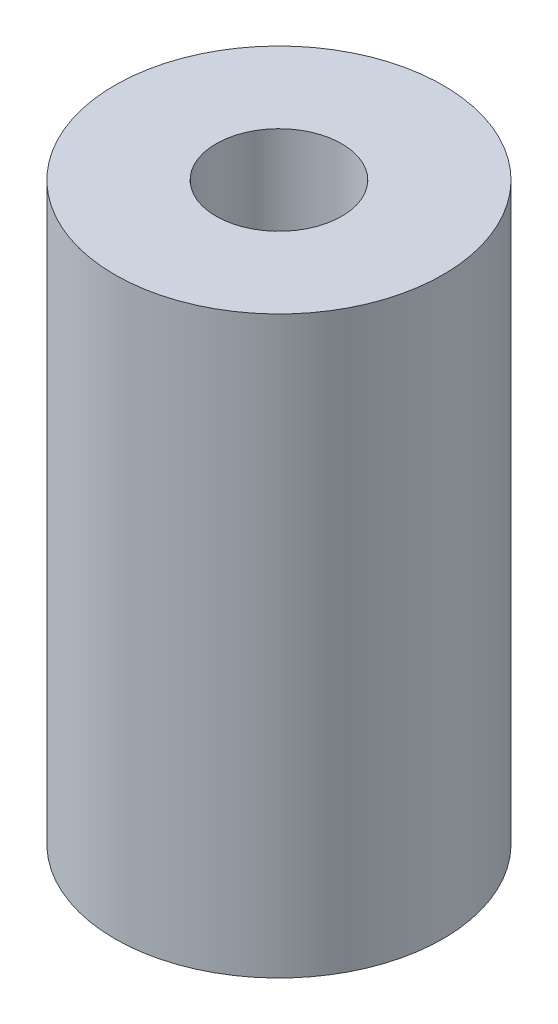
ISO-10303-21;
HEADER;
FILE_DESCRIPTION(('STEP AP214'),'2;1');
FILE_NAME('part.step','',(''),(''),'','','');
FILE_SCHEMA(('AUTOMOTIVE_DESIGN { 1 0 10303 214 1 1 1 1 }'));
ENDSEC;
DATA;
#1=APPLICATION_CONTEXT('core data for automotive mechanical design processes');
#2=APPLICATION_PROTOCOL_DEFINITION('international standard','automotive_design',2000,#1);
#3=PRODUCT_CONTEXT('',#1,'mechanical');
#4=PRODUCT('Part','Part','',(#3));
#5=PRODUCT_RELATED_PRODUCT_CATEGORY('part','',(#4));
#6=PRODUCT_DEFINITION_FORMATION('','',#4);
#7=PRODUCT_DEFINITION_CONTEXT('part definition',#1,'design');
#8=PRODUCT_DEFINITION('design','',#6,#7);
#9=PRODUCT_DEFINITION_SHAPE('','',#8);
#10=(LENGTH_UNIT() NAMED_UNIT(*) SI_UNIT(.MILLI.,.METRE.));
#11=(NAMED_UNIT(*) PLANE_ANGLE_UNIT() SI_UNIT($,.RADIAN.));
#12=(NAMED_UNIT(*) SI_UNIT($,.STERADIAN.) SOLID_ANGLE_UNIT());
#13=UNCERTAINTY_MEASURE_WITH_UNIT(LENGTH_MEASURE(1.E-05),#10,'distance_accuracy_value','');
#14=(GEOMETRIC_REPRESENTATION_CONTEXT(3) GLOBAL_UNCERTAINTY_ASSIGNED_CONTEXT((#13)) GLOBAL_UNIT_ASSIGNED_CONTEXT((#10,
#11,#12)) REPRESENTATION_CONTEXT('',''));
#15=CARTESIAN_POINT('',(0.,0.,0.));
#16=DIRECTION('',(0.,0.,1.));
#17=DIRECTION('',(1.,0.,0.));
#18=AXIS2_PLACEMENT_3D('',#15,#16,#17);
#19=CARTESIAN_POINT('',(0.,82.35,0.));
#20=DIRECTION('',(0.,-1.,0.));
#21=DIRECTION('',(0.,0.,-1.));
#22=AXIS2_PLACEMENT_3D('',#19,#20,#21);
#23=CYLINDRICAL_SURFACE('',#22,23.5);
#24=CARTESIAN_POINT('',(0.,82.35,0.));
#25=DIRECTION('',(0.,1.,0.));
#26=DIRECTION('',(0.,0.,1.));
#27=AXIS2_PLACEMENT_3D('',#24,#25,#26);
#28=CIRCLE('',#27,23.5);
#29=CARTESIAN_POINT('',(0.,82.35,23.5));
#30=VERTEX_POINT('',#29);
#31=EDGE_CURVE('E10',#30,#30,#28,.T.);
#32=ORIENTED_EDGE('',*,*,#31,.F.);
#33=EDGE_LOOP('',(#32));
#34=FACE_BOUND('',#33,.T.);
#35=CARTESIAN_POINT('',(0.,0.,0.));
#36=DIRECTION('',(0.,1.,0.));
#37=DIRECTION('',(0.,0.,1.));
#38=AXIS2_PLACEMENT_3D('',#35,#36,#37);
#39=CIRCLE('',#38,23.5);
#40=CARTESIAN_POINT('',(0.,0.,23.5));
#41=VERTEX_POINT('',#40);
#42=EDGE_CURVE('E45',#41,#41,#39,.T.);
#43=ORIENTED_EDGE('',*,*,#42,.T.);
#44=EDGE_LOOP('',(#43));
#45=FACE_BOUND('',#44,.T.);
#46=ADVANCED_FACE('F37',(#34,#45),#23,.T.);
#47=CARTESIAN_POINT('',(0.,82.35,0.));
#48=DIRECTION('',(0.,1.,0.));
#49=DIRECTION('',(0.,0.,1.));
#50=AXIS2_PLACEMENT_3D('',#47,#48,#49);
#51=PLANE('',#50);
#52=CARTESIAN_POINT('',(0.,82.35,0.));
#53=DIRECTION('',(0.,1.,0.));
#54=DIRECTION('',(0.,0.,1.));
#55=AXIS2_PLACEMENT_3D('',#52,#53,#54);
#56=CIRCLE('',#55,9.);
#57=CARTESIAN_POINT('',(0.,82.35,9.));
#58=VERTEX_POINT('',#57);
#59=EDGE_CURVE('E52',#58,#58,#56,.T.);
#60=ORIENTED_EDGE('',*,*,#59,.F.);
#61=EDGE_LOOP('',(#60));
#62=FACE_BOUND('',#61,.T.);
#63=ORIENTED_EDGE('',*,*,#31,.T.);
#64=EDGE_LOOP('',(#63));
#65=FACE_BOUND('',#64,.T.);
#66=ADVANCED_FACE('F70',(#62,#65),#51,.T.);
#67=CARTESIAN_POINT('',(0.,0.,0.));
#68=DIRECTION('',(0.,1.,0.));
#69=DIRECTION('',(0.,0.,1.));
#70=AXIS2_PLACEMENT_3D('',#67,#68,#69);
#71=PLANE('',#70);
#72=CARTESIAN_POINT('',(0.,0.,0.));
#73=DIRECTION('',(0.,1.,0.));
#74=DIRECTION('',(0.,0.,1.));
#75=AXIS2_PLACEMENT_3D('',#72,#73,#74);
#76=CIRCLE('',#75,9.);
#77=CARTESIAN_POINT('',(0.,0.,9.));
#78=VERTEX_POINT('',#77);
#79=EDGE_CURVE('E40',#78,#78,#76,.T.);
#80=ORIENTED_EDGE('',*,*,#79,.T.);
#81=EDGE_LOOP('',(#80));
#82=FACE_BOUND('',#81,.T.);
#83=ORIENTED_EDGE('',*,*,#42,.F.);
#84=EDGE_LOOP('',(#83));
#85=FACE_BOUND('',#84,.T.);
#86=ADVANCED_FACE('F61',(#82,#85),#71,.F.);
#87=CARTESIAN_POINT('',(0.,-17.65,0.));
#88=DIRECTION('',(0.,1.,0.));
#89=DIRECTION('',(0.,0.,1.));
#90=AXIS2_PLACEMENT_3D('',#87,#88,#89);
#91=CYLINDRICAL_SURFACE('',#90,9.);
#92=ORIENTED_EDGE('',*,*,#59,.T.);
#93=EDGE_LOOP('',(#92));
#94=FACE_BOUND('',#93,.T.);
#95=ORIENTED_EDGE('',*,*,#79,.F.);
#96=EDGE_LOOP('',(#95));
#97=FACE_BOUND('',#96,.T.);
#98=ADVANCED_FACE('F64',(#94,#97),#91,.F.);
#99=CLOSED_SHELL('',(#46,#66,#86,#98));
#100=MANIFOLD_SOLID_BREP('B2',#99);
#101=ADVANCED_BREP_SHAPE_REPRESENTATION('',(#18,#100),#14);
#102=SHAPE_DEFINITION_REPRESENTATION(#9,#101);
ENDSEC;
END-ISO-10303-21;
